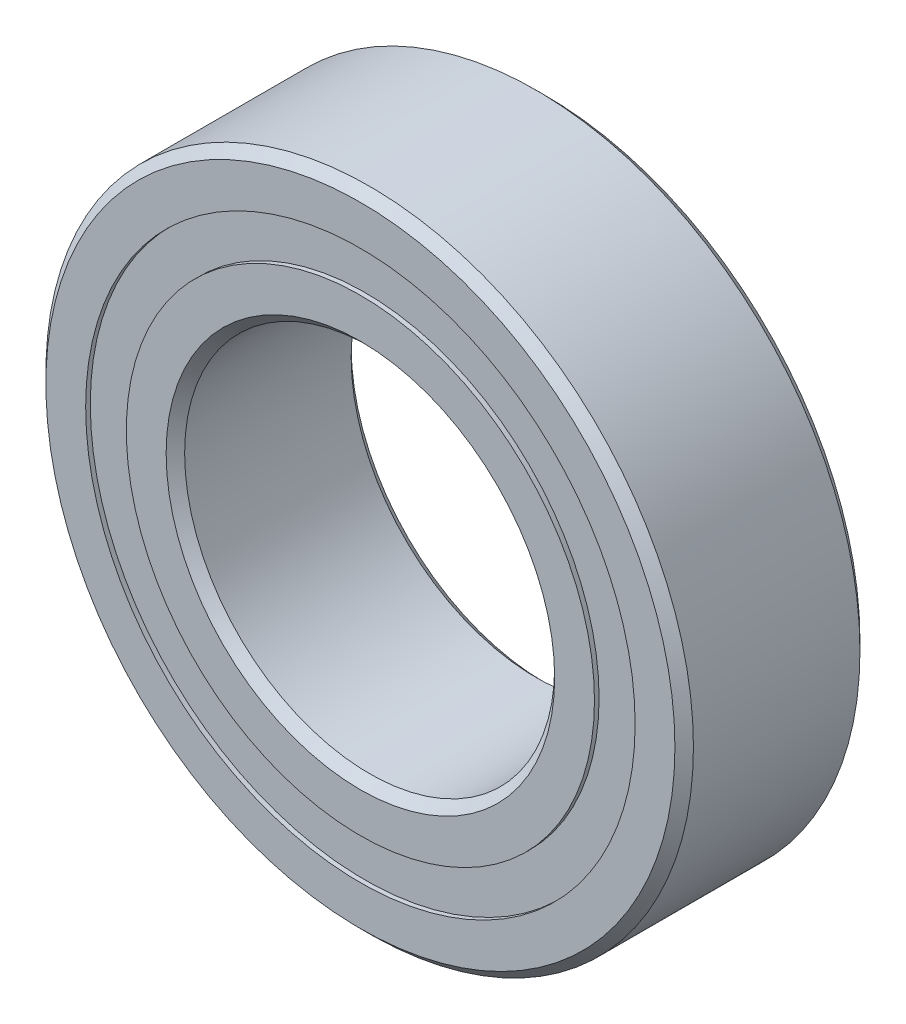
ISO-10303-21;
HEADER;
FILE_DESCRIPTION(('STEP AP214'),'2;1');
FILE_NAME('part.step','',(''),(''),'','','');
FILE_SCHEMA(('AUTOMOTIVE_DESIGN { 1 0 10303 214 1 1 1 1 }'));
ENDSEC;
DATA;
#1=APPLICATION_CONTEXT('core data for automotive mechanical design processes');
#2=APPLICATION_PROTOCOL_DEFINITION('international standard','automotive_design',2000,#1);
#3=PRODUCT_CONTEXT('',#1,'mechanical');
#4=PRODUCT('Part','Part','',(#3));
#5=PRODUCT_RELATED_PRODUCT_CATEGORY('part','',(#4));
#6=PRODUCT_DEFINITION_FORMATION('','',#4);
#7=PRODUCT_DEFINITION_CONTEXT('part definition',#1,'design');
#8=PRODUCT_DEFINITION('design','',#6,#7);
#9=PRODUCT_DEFINITION_SHAPE('','',#8);
#10=(LENGTH_UNIT() NAMED_UNIT(*) SI_UNIT(.MILLI.,.METRE.));
#11=(NAMED_UNIT(*) PLANE_ANGLE_UNIT() SI_UNIT($,.RADIAN.));
#12=(NAMED_UNIT(*) SI_UNIT($,.STERADIAN.) SOLID_ANGLE_UNIT());
#13=UNCERTAINTY_MEASURE_WITH_UNIT(LENGTH_MEASURE(1.E-05),#10,'distance_accuracy_value','');
#14=(GEOMETRIC_REPRESENTATION_CONTEXT(3) GLOBAL_UNCERTAINTY_ASSIGNED_CONTEXT((#13)) GLOBAL_UNIT_ASSIGNED_CONTEXT((#10,
#11,#12)) REPRESENTATION_CONTEXT('',''));
#15=CARTESIAN_POINT('',(0.,0.,0.));
#16=DIRECTION('',(0.,0.,1.));
#17=DIRECTION('',(1.,0.,0.));
#18=AXIS2_PLACEMENT_3D('',#15,#16,#17);
#19=CARTESIAN_POINT('',(0.,5.93956043956044,-1.9));
#20=DIRECTION('',(0.,0.,1.));
#21=DIRECTION('',(1.,0.,0.));
#22=AXIS2_PLACEMENT_3D('',#19,#20,#21);
#23=PLANE('',#22);
#24=CARTESIAN_POINT('',(0.,0.,-1.9));
#25=DIRECTION('',(0.,0.,1.));
#26=DIRECTION('',(1.,0.,0.));
#27=AXIS2_PLACEMENT_3D('',#24,#25,#26);
#28=CIRCLE('',#27,5.93956043956044);
#29=CARTESIAN_POINT('',(5.93956043956044,0.,-1.9));
#30=VERTEX_POINT('',#29);
#31=EDGE_CURVE('E56',#30,#30,#28,.T.);
#32=ORIENTED_EDGE('',*,*,#31,.F.);
#33=EDGE_LOOP('',(#32));
#34=FACE_BOUND('',#33,.T.);
#35=CARTESIAN_POINT('',(0.,0.,-1.9));
#36=DIRECTION('',(0.,0.,1.));
#37=DIRECTION('',(1.,0.,0.));
#38=AXIS2_PLACEMENT_3D('',#35,#36,#37);
#39=CIRCLE('',#38,5.06043956043956);
#40=CARTESIAN_POINT('',(5.06043956043956,0.,-1.9));
#41=VERTEX_POINT('',#40);
#42=EDGE_CURVE('E11',#41,#41,#39,.T.);
#43=ORIENTED_EDGE('',*,*,#42,.T.);
#44=EDGE_LOOP('',(#43));
#45=FACE_BOUND('',#44,.T.);
#46=ADVANCED_FACE('F42',(#34,#45),#23,.F.);
#47=CARTESIAN_POINT('',(0.,0.,2.));
#48=DIRECTION('',(0.,0.,1.));
#49=DIRECTION('',(1.,0.,0.));
#50=AXIS2_PLACEMENT_3D('',#47,#48,#49);
#51=CYLINDRICAL_SURFACE('',#50,5.06043956043956);
#52=ORIENTED_EDGE('',*,*,#42,.F.);
#53=EDGE_LOOP('',(#52));
#54=FACE_BOUND('',#53,.T.);
#55=CARTESIAN_POINT('',(0.,0.,-0.991633418565898));
#56=DIRECTION('',(0.,0.,1.));
#57=DIRECTION('',(1.,0.,0.));
#58=AXIS2_PLACEMENT_3D('',#55,#56,#57);
#59=CIRCLE('',#58,5.06043956043956);
#60=CARTESIAN_POINT('',(5.06043956043956,0.,-0.991633418565898));
#61=VERTEX_POINT('',#60);
#62=EDGE_CURVE('E48',#61,#61,#59,.T.);
#63=ORIENTED_EDGE('',*,*,#62,.T.);
#64=EDGE_LOOP('',(#63));
#65=FACE_BOUND('',#64,.T.);
#66=ADVANCED_FACE('F65',(#54,#65),#51,.F.);
#67=CARTESIAN_POINT('',(0.,5.93956043956044,-0.991633418565898));
#68=DIRECTION('',(0.,0.,-1.));
#69=DIRECTION('',(-1.,0.,0.));
#70=AXIS2_PLACEMENT_3D('',#67,#68,#69);
#71=PLANE('',#70);
#72=ORIENTED_EDGE('',*,*,#62,.F.);
#73=EDGE_LOOP('',(#72));
#74=FACE_BOUND('',#73,.T.);
#75=CARTESIAN_POINT('',(0.,0.,-0.991633418565898));
#76=DIRECTION('',(0.,0.,1.));
#77=DIRECTION('',(1.,0.,0.));
#78=AXIS2_PLACEMENT_3D('',#75,#76,#77);
#79=CIRCLE('',#78,5.93956043956044);
#80=CARTESIAN_POINT('',(5.93956043956044,0.,-0.991633418565898));
#81=VERTEX_POINT('',#80);
#82=EDGE_CURVE('E52',#81,#81,#79,.T.);
#83=ORIENTED_EDGE('',*,*,#82,.T.);
#84=EDGE_LOOP('',(#83));
#85=FACE_BOUND('',#84,.T.);
#86=ADVANCED_FACE('F69',(#74,#85),#71,.F.);
#87=CARTESIAN_POINT('',(0.,0.,2.));
#88=DIRECTION('',(0.,0.,1.));
#89=DIRECTION('',(1.,0.,0.));
#90=AXIS2_PLACEMENT_3D('',#87,#88,#89);
#91=CYLINDRICAL_SURFACE('',#90,5.93956043956044);
#92=ORIENTED_EDGE('',*,*,#82,.F.);
#93=EDGE_LOOP('',(#92));
#94=FACE_BOUND('',#93,.T.);
#95=ORIENTED_EDGE('',*,*,#31,.T.);
#96=EDGE_LOOP('',(#95));
#97=FACE_BOUND('',#96,.T.);
#98=ADVANCED_FACE('F62',(#94,#97),#91,.T.);
#99=CLOSED_SHELL('',(#46,#66,#86,#98));
#100=MANIFOLD_SOLID_BREP('B2',#99);
#101=CARTESIAN_POINT('',(0.,5.93956043956044,1.9));
#102=DIRECTION('',(0.,0.,-1.));
#103=DIRECTION('',(-1.,0.,0.));
#104=AXIS2_PLACEMENT_3D('',#101,#102,#103);
#105=PLANE('',#104);
#106=CARTESIAN_POINT('',(0.,0.,1.9));
#107=DIRECTION('',(0.,0.,1.));
#108=DIRECTION('',(1.,0.,0.));
#109=AXIS2_PLACEMENT_3D('',#106,#107,#108);
#110=CIRCLE('',#109,5.06043956043956);
#111=CARTESIAN_POINT('',(5.06043956043956,0.,1.9));
#112=VERTEX_POINT('',#111);
#113=EDGE_CURVE('E41',#112,#112,#110,.T.);
#114=ORIENTED_EDGE('',*,*,#113,.F.);
#115=EDGE_LOOP('',(#114));
#116=FACE_BOUND('',#115,.T.);
#117=CARTESIAN_POINT('',(0.,0.,1.9));
#118=DIRECTION('',(0.,0.,1.));
#119=DIRECTION('',(1.,0.,0.));
#120=AXIS2_PLACEMENT_3D('',#117,#118,#119);
#121=CIRCLE('',#120,5.93956043956044);
#122=CARTESIAN_POINT('',(5.93956043956044,0.,1.9));
#123=VERTEX_POINT('',#122);
#124=EDGE_CURVE('E124',#123,#123,#121,.T.);
#125=ORIENTED_EDGE('',*,*,#124,.T.);
#126=EDGE_LOOP('',(#125));
#127=FACE_BOUND('',#126,.T.);
#128=ADVANCED_FACE('F110',(#116,#127),#105,.F.);
#129=CARTESIAN_POINT('',(0.,0.,2.));
#130=DIRECTION('',(0.,0.,1.));
#131=DIRECTION('',(1.,0.,0.));
#132=AXIS2_PLACEMENT_3D('',#129,#130,#131);
#133=CYLINDRICAL_SURFACE('',#132,5.06043956043956);
#134=CARTESIAN_POINT('',(0.,0.,0.991633418565898));
#135=DIRECTION('',(0.,0.,1.));
#136=DIRECTION('',(1.,0.,0.));
#137=AXIS2_PLACEMENT_3D('',#134,#135,#136);
#138=CIRCLE('',#137,5.06043956043956);
#139=CARTESIAN_POINT('',(5.06043956043956,0.,0.991633418565898));
#140=VERTEX_POINT('',#139);
#141=EDGE_CURVE('E116',#140,#140,#138,.T.);
#142=ORIENTED_EDGE('',*,*,#141,.F.);
#143=EDGE_LOOP('',(#142));
#144=FACE_BOUND('',#143,.T.);
#145=ORIENTED_EDGE('',*,*,#113,.T.);
#146=EDGE_LOOP('',(#145));
#147=FACE_BOUND('',#146,.T.);
#148=ADVANCED_FACE('F139',(#144,#147),#133,.F.);
#149=CARTESIAN_POINT('',(0.,5.93956043956044,0.991633418565898));
#150=DIRECTION('',(0.,0.,1.));
#151=DIRECTION('',(1.,0.,0.));
#152=AXIS2_PLACEMENT_3D('',#149,#150,#151);
#153=PLANE('',#152);
#154=CARTESIAN_POINT('',(0.,0.,0.991633418565898));
#155=DIRECTION('',(0.,0.,1.));
#156=DIRECTION('',(1.,0.,0.));
#157=AXIS2_PLACEMENT_3D('',#154,#155,#156);
#158=CIRCLE('',#157,5.93956043956044);
#159=CARTESIAN_POINT('',(5.93956043956044,0.,0.991633418565898));
#160=VERTEX_POINT('',#159);
#161=EDGE_CURVE('E120',#160,#160,#158,.T.);
#162=ORIENTED_EDGE('',*,*,#161,.F.);
#163=EDGE_LOOP('',(#162));
#164=FACE_BOUND('',#163,.T.);
#165=ORIENTED_EDGE('',*,*,#141,.T.);
#166=EDGE_LOOP('',(#165));
#167=FACE_BOUND('',#166,.T.);
#168=ADVANCED_FACE('F134',(#164,#167),#153,.F.);
#169=CARTESIAN_POINT('',(0.,0.,2.));
#170=DIRECTION('',(0.,0.,1.));
#171=DIRECTION('',(1.,0.,0.));
#172=AXIS2_PLACEMENT_3D('',#169,#170,#171);
#173=CYLINDRICAL_SURFACE('',#172,5.93956043956044);
#174=ORIENTED_EDGE('',*,*,#124,.F.);
#175=EDGE_LOOP('',(#174));
#176=FACE_BOUND('',#175,.T.);
#177=ORIENTED_EDGE('',*,*,#161,.T.);
#178=EDGE_LOOP('',(#177));
#179=FACE_BOUND('',#178,.T.);
#180=ADVANCED_FACE('F131',(#176,#179),#173,.T.);
#181=CLOSED_SHELL('',(#128,#148,#168,#180));
#182=MANIFOLD_SOLID_BREP('B6',#181);
#183=CARTESIAN_POINT('',(-2.74999999999994,4.76313972081445,0.));
#184=DIRECTION('',(0.,0.,1.));
#185=DIRECTION('',(-0.499999999999989,0.866025403784445,0.));
#186=AXIS2_PLACEMENT_3D('',#183,#184,#185);
#187=SPHERICAL_SURFACE('',#186,0.991633418565898);
#188=CARTESIAN_POINT('',(-2.74999999999994,4.76313972081445,0.991633418565898));
#189=VERTEX_POINT('',#188);
#190=VERTEX_LOOP('',#189);
#191=FACE_BOUND('',#190,.T.);
#192=ADVANCED_FACE('F178',(#191),#187,.T.);
#193=CLOSED_SHELL('',(#192));
#194=MANIFOLD_SOLID_BREP('B36',#193);
#195=CARTESIAN_POINT('',(-4.76313972081438,2.75000000000006,0.));
#196=DIRECTION('',(0.,0.,1.));
#197=DIRECTION('',(-0.866025403784433,0.50000000000001,0.));
#198=AXIS2_PLACEMENT_3D('',#195,#196,#197);
#199=SPHERICAL_SURFACE('',#198,0.991633418565898);
#200=CARTESIAN_POINT('',(-4.76313972081438,2.75000000000006,0.991633418565898));
#201=VERTEX_POINT('',#200);
#202=VERTEX_LOOP('',#201);
#203=FACE_BOUND('',#202,.T.);
#204=ADVANCED_FACE('F199',(#203),#199,.T.);
#205=CLOSED_SHELL('',(#204));
#206=MANIFOLD_SOLID_BREP('B106',#205);
#207=CARTESIAN_POINT('',(-5.5,0.,0.));
#208=DIRECTION('',(0.,0.,1.));
#209=DIRECTION('',(-1.,0.,0.));
#210=AXIS2_PLACEMENT_3D('',#207,#208,#209);
#211=SPHERICAL_SURFACE('',#210,0.991633418565898);
#212=CARTESIAN_POINT('',(-5.5,0.,0.991633418565898));
#213=VERTEX_POINT('',#212);
#214=VERTEX_LOOP('',#213);
#215=FACE_BOUND('',#214,.T.);
#216=ADVANCED_FACE('F220',(#215),#211,.T.);
#217=CLOSED_SHELL('',(#216));
#218=MANIFOLD_SOLID_BREP('B174',#217);
#219=CARTESIAN_POINT('',(-4.76313972081444,-2.74999999999996,0.));
#220=DIRECTION('',(0.,0.,1.));
#221=DIRECTION('',(-0.866025403784443,-0.499999999999992,0.));
#222=AXIS2_PLACEMENT_3D('',#219,#220,#221);
#223=SPHERICAL_SURFACE('',#222,0.991633418565898);
#224=CARTESIAN_POINT('',(-4.76313972081444,-2.74999999999996,0.991633418565898));
#225=VERTEX_POINT('',#224);
#226=VERTEX_LOOP('',#225);
#227=FACE_BOUND('',#226,.T.);
#228=ADVANCED_FACE('F241',(#227),#223,.T.);
#229=CLOSED_SHELL('',(#228));
#230=MANIFOLD_SOLID_BREP('B195',#229);
#231=CARTESIAN_POINT('',(-2.75000000000004,-4.76313972081439,0.));
#232=DIRECTION('',(0.,0.,1.));
#233=DIRECTION('',(-0.500000000000007,-0.866025403784435,0.));
#234=AXIS2_PLACEMENT_3D('',#231,#232,#233);
#235=SPHERICAL_SURFACE('',#234,0.991633418565898);
#236=CARTESIAN_POINT('',(-2.75000000000004,-4.76313972081439,0.991633418565898));
#237=VERTEX_POINT('',#236);
#238=VERTEX_LOOP('',#237);
#239=FACE_BOUND('',#238,.T.);
#240=ADVANCED_FACE('F262',(#239),#235,.T.);
#241=CLOSED_SHELL('',(#240));
#242=MANIFOLD_SOLID_BREP('B216',#241);
#243=CARTESIAN_POINT('',(0.,-5.5,0.));
#244=DIRECTION('',(0.,0.,1.));
#245=DIRECTION('',(0.,-1.,0.));
#246=AXIS2_PLACEMENT_3D('',#243,#244,#245);
#247=SPHERICAL_SURFACE('',#246,0.991633418565898);
#248=CARTESIAN_POINT('',(0.,-5.5,0.991633418565898));
#249=VERTEX_POINT('',#248);
#250=VERTEX_LOOP('',#249);
#251=FACE_BOUND('',#250,.T.);
#252=ADVANCED_FACE('F283',(#251),#247,.T.);
#253=CLOSED_SHELL('',(#252));
#254=MANIFOLD_SOLID_BREP('B237',#253);
#255=CARTESIAN_POINT('',(2.74999999999997,-4.76313972081443,0.));
#256=DIRECTION('',(0.,0.,1.));
#257=DIRECTION('',(0.499999999999995,-0.866025403784442,0.));
#258=AXIS2_PLACEMENT_3D('',#255,#256,#257);
#259=SPHERICAL_SURFACE('',#258,0.991633418565898);
#260=CARTESIAN_POINT('',(2.74999999999997,-4.76313972081443,0.991633418565898));
#261=VERTEX_POINT('',#260);
#262=VERTEX_LOOP('',#261);
#263=FACE_BOUND('',#262,.T.);
#264=ADVANCED_FACE('F304',(#263),#259,.T.);
#265=CLOSED_SHELL('',(#264));
#266=MANIFOLD_SOLID_BREP('B258',#265);
#267=CARTESIAN_POINT('',(4.7631397208144,-2.75000000000002,0.));
#268=DIRECTION('',(0.,0.,1.));
#269=DIRECTION('',(0.866025403784436,-0.500000000000004,0.));
#270=AXIS2_PLACEMENT_3D('',#267,#268,#269);
#271=SPHERICAL_SURFACE('',#270,0.991633418565898);
#272=CARTESIAN_POINT('',(4.7631397208144,-2.75000000000002,0.991633418565898));
#273=VERTEX_POINT('',#272);
#274=VERTEX_LOOP('',#273);
#275=FACE_BOUND('',#274,.T.);
#276=ADVANCED_FACE('F325',(#275),#271,.T.);
#277=CLOSED_SHELL('',(#276));
#278=MANIFOLD_SOLID_BREP('B279',#277);
#279=CARTESIAN_POINT('',(5.5,0.,0.));
#280=DIRECTION('',(0.,0.,1.));
#281=DIRECTION('',(1.,0.,0.));
#282=AXIS2_PLACEMENT_3D('',#279,#280,#281);
#283=SPHERICAL_SURFACE('',#282,0.991633418565898);
#284=CARTESIAN_POINT('',(5.5,0.,0.991633418565898));
#285=VERTEX_POINT('',#284);
#286=VERTEX_LOOP('',#285);
#287=FACE_BOUND('',#286,.T.);
#288=ADVANCED_FACE('F346',(#287),#283,.T.);
#289=CLOSED_SHELL('',(#288));
#290=MANIFOLD_SOLID_BREP('B300',#289);
#291=CARTESIAN_POINT('',(4.76313972081442,2.74999999999999,0.));
#292=DIRECTION('',(0.,0.,1.));
#293=DIRECTION('',(0.86602540378444,0.499999999999998,0.));
#294=AXIS2_PLACEMENT_3D('',#291,#292,#293);
#295=SPHERICAL_SURFACE('',#294,0.991633418565898);
#296=CARTESIAN_POINT('',(4.76313972081442,2.74999999999999,0.991633418565898));
#297=VERTEX_POINT('',#296);
#298=VERTEX_LOOP('',#297);
#299=FACE_BOUND('',#298,.T.);
#300=ADVANCED_FACE('F367',(#299),#295,.T.);
#301=CLOSED_SHELL('',(#300));
#302=MANIFOLD_SOLID_BREP('B321',#301);
#303=CARTESIAN_POINT('',(2.75000000000001,4.76313972081441,0.));
#304=DIRECTION('',(0.,0.,1.));
#305=DIRECTION('',(0.500000000000001,0.866025403784438,0.));
#306=AXIS2_PLACEMENT_3D('',#303,#304,#305);
#307=SPHERICAL_SURFACE('',#306,0.991633418565898);
#308=CARTESIAN_POINT('',(2.75000000000001,4.76313972081441,0.991633418565898));
#309=VERTEX_POINT('',#308);
#310=VERTEX_LOOP('',#309);
#311=FACE_BOUND('',#310,.T.);
#312=ADVANCED_FACE('F388',(#311),#307,.T.);
#313=CLOSED_SHELL('',(#312));
#314=MANIFOLD_SOLID_BREP('B342',#313);
#315=CARTESIAN_POINT('',(0.,5.5,0.));
#316=DIRECTION('',(0.,0.,1.));
#317=DIRECTION('',(0.,1.,0.));
#318=AXIS2_PLACEMENT_3D('',#315,#316,#317);
#319=SPHERICAL_SURFACE('',#318,0.991633418565898);
#320=CARTESIAN_POINT('',(0.,5.5,0.991633418565898));
#321=VERTEX_POINT('',#320);
#322=VERTEX_LOOP('',#321);
#323=FACE_BOUND('',#322,.T.);
#324=ADVANCED_FACE('F411',(#323),#319,.T.);
#325=CLOSED_SHELL('',(#324));
#326=MANIFOLD_SOLID_BREP('B363',#325);
#327=CARTESIAN_POINT('',(0.,5.06043956043956,2.));
#328=DIRECTION('',(0.,0.,-1.));
#329=DIRECTION('',(-1.,0.,0.));
#330=AXIS2_PLACEMENT_3D('',#327,#328,#329);
#331=PLANE('',#330);
#332=CARTESIAN_POINT('',(0.,0.,2.));
#333=DIRECTION('',(0.,0.,1.));
#334=DIRECTION('',(1.,0.,0.));
#335=AXIS2_PLACEMENT_3D('',#332,#333,#334);
#336=CIRCLE('',#335,4.2);
#337=CARTESIAN_POINT('',(4.2,0.,2.));
#338=VERTEX_POINT('',#337);
#339=EDGE_CURVE('E459',#338,#338,#336,.T.);
#340=ORIENTED_EDGE('',*,*,#339,.F.);
#341=EDGE_LOOP('',(#340));
#342=FACE_BOUND('',#341,.T.);
#343=CARTESIAN_POINT('',(0.,0.,2.));
#344=DIRECTION('',(0.,0.,1.));
#345=DIRECTION('',(1.,0.,0.));
#346=AXIS2_PLACEMENT_3D('',#343,#344,#345);
#347=CIRCLE('',#346,5.06043956043956);
#348=CARTESIAN_POINT('',(5.06043956043956,0.,2.));
#349=VERTEX_POINT('',#348);
#350=EDGE_CURVE('E410',#349,#349,#347,.T.);
#351=ORIENTED_EDGE('',*,*,#350,.T.);
#352=EDGE_LOOP('',(#351));
#353=FACE_BOUND('',#352,.T.);
#354=ADVANCED_FACE('F431',(#342,#353),#331,.F.);
#355=CARTESIAN_POINT('',(0.,0.,2.));
#356=DIRECTION('',(0.,0.,1.));
#357=DIRECTION('',(1.,0.,0.));
#358=AXIS2_PLACEMENT_3D('',#355,#356,#357);
#359=CYLINDRICAL_SURFACE('',#358,5.06043956043956);
#360=ORIENTED_EDGE('',*,*,#350,.F.);
#361=EDGE_LOOP('',(#360));
#362=FACE_BOUND('',#361,.T.);
#363=CARTESIAN_POINT('',(0.,0.,0.888888888888889));
#364=DIRECTION('',(0.,0.,1.));
#365=DIRECTION('',(1.,0.,0.));
#366=AXIS2_PLACEMENT_3D('',#363,#364,#365);
#367=CIRCLE('',#366,5.06043956043956);
#368=CARTESIAN_POINT('',(5.06043956043956,0.,0.888888888888889));
#369=VERTEX_POINT('',#368);
#370=EDGE_CURVE('E437',#369,#369,#367,.T.);
#371=ORIENTED_EDGE('',*,*,#370,.T.);
#372=EDGE_LOOP('',(#371));
#373=FACE_BOUND('',#372,.T.);
#374=ADVANCED_FACE('F466',(#362,#373),#359,.T.);
#375=CARTESIAN_POINT('',(0.,0.,0.));
#376=DIRECTION('',(0.,0.,1.));
#377=DIRECTION('',(1.,0.,0.));
#378=AXIS2_PLACEMENT_3D('',#375,#376,#377);
#379=TOROIDAL_SURFACE('',#378,5.5,0.991633418565897);
#380=ORIENTED_EDGE('',*,*,#370,.F.);
#381=EDGE_LOOP('',(#380));
#382=FACE_BOUND('',#381,.T.);
#383=CARTESIAN_POINT('',(0.,0.,-0.88888888888889));
#384=DIRECTION('',(0.,0.,1.));
#385=DIRECTION('',(1.,0.,0.));
#386=AXIS2_PLACEMENT_3D('',#383,#384,#385);
#387=CIRCLE('',#386,5.06043956043956);
#388=CARTESIAN_POINT('',(5.06043956043956,0.,-0.88888888888889));
#389=VERTEX_POINT('',#388);
#390=EDGE_CURVE('E441',#389,#389,#387,.T.);
#391=ORIENTED_EDGE('',*,*,#390,.T.);
#392=EDGE_LOOP('',(#391));
#393=FACE_BOUND('',#392,.T.);
#394=ADVANCED_FACE('F470',(#382,#393),#379,.F.);
#395=CARTESIAN_POINT('',(0.,0.,2.));
#396=DIRECTION('',(0.,0.,1.));
#397=DIRECTION('',(1.,0.,0.));
#398=AXIS2_PLACEMENT_3D('',#395,#396,#397);
#399=CYLINDRICAL_SURFACE('',#398,5.06043956043956);
#400=ORIENTED_EDGE('',*,*,#390,.F.);
#401=EDGE_LOOP('',(#400));
#402=FACE_BOUND('',#401,.T.);
#403=CARTESIAN_POINT('',(0.,0.,-2.));
#404=DIRECTION('',(0.,0.,1.));
#405=DIRECTION('',(1.,0.,0.));
#406=AXIS2_PLACEMENT_3D('',#403,#404,#405);
#407=CIRCLE('',#406,5.06043956043956);
#408=CARTESIAN_POINT('',(5.06043956043956,0.,-2.));
#409=VERTEX_POINT('',#408);
#410=EDGE_CURVE('E445',#409,#409,#407,.T.);
#411=ORIENTED_EDGE('',*,*,#410,.T.);
#412=EDGE_LOOP('',(#411));
#413=FACE_BOUND('',#412,.T.);
#414=ADVANCED_FACE('F475',(#402,#413),#399,.T.);
#415=CARTESIAN_POINT('',(0.,4.2,-2.));
#416=DIRECTION('',(0.,0.,1.));
#417=DIRECTION('',(1.,0.,0.));
#418=AXIS2_PLACEMENT_3D('',#415,#416,#417);
#419=PLANE('',#418);
#420=ORIENTED_EDGE('',*,*,#410,.F.);
#421=EDGE_LOOP('',(#420));
#422=FACE_BOUND('',#421,.T.);
#423=CARTESIAN_POINT('',(0.,0.,-2.));
#424=DIRECTION('',(0.,0.,1.));
#425=DIRECTION('',(1.,0.,0.));
#426=AXIS2_PLACEMENT_3D('',#423,#424,#425);
#427=CIRCLE('',#426,4.2);
#428=CARTESIAN_POINT('',(4.2,0.,-2.));
#429=VERTEX_POINT('',#428);
#430=EDGE_CURVE('E450',#429,#429,#427,.T.);
#431=ORIENTED_EDGE('',*,*,#430,.T.);
#432=EDGE_LOOP('',(#431));
#433=FACE_BOUND('',#432,.T.);
#434=ADVANCED_FACE('F481',(#422,#433),#419,.F.);
#435=CARTESIAN_POINT('',(0.,0.,-1.8));
#436=DIRECTION('',(0.,0.,-1.));
#437=DIRECTION('',(-1.,0.,0.));
#438=AXIS2_PLACEMENT_3D('',#435,#436,#437);
#439=CONICAL_SURFACE('',#438,4.,0.785398163397446);
#440=ORIENTED_EDGE('',*,*,#430,.F.);
#441=EDGE_LOOP('',(#440));
#442=FACE_BOUND('',#441,.T.);
#443=CARTESIAN_POINT('',(0.,0.,-1.8));
#444=DIRECTION('',(0.,0.,1.));
#445=DIRECTION('',(1.,0.,0.));
#446=AXIS2_PLACEMENT_3D('',#443,#444,#445);
#447=CIRCLE('',#446,4.);
#448=CARTESIAN_POINT('',(4.,0.,-1.8));
#449=VERTEX_POINT('',#448);
#450=EDGE_CURVE('E453',#449,#449,#447,.T.);
#451=ORIENTED_EDGE('',*,*,#450,.T.);
#452=EDGE_LOOP('',(#451));
#453=FACE_BOUND('',#452,.T.);
#454=ADVANCED_FACE('F485',(#442,#453),#439,.F.);
#455=CARTESIAN_POINT('',(0.,0.,2.));
#456=DIRECTION('',(0.,0.,1.));
#457=DIRECTION('',(1.,0.,0.));
#458=AXIS2_PLACEMENT_3D('',#455,#456,#457);
#459=CYLINDRICAL_SURFACE('',#458,4.);
#460=ORIENTED_EDGE('',*,*,#450,.F.);
#461=EDGE_LOOP('',(#460));
#462=FACE_BOUND('',#461,.T.);
#463=CARTESIAN_POINT('',(0.,0.,1.8));
#464=DIRECTION('',(0.,0.,1.));
#465=DIRECTION('',(1.,0.,0.));
#466=AXIS2_PLACEMENT_3D('',#463,#464,#465);
#467=CIRCLE('',#466,4.);
#468=CARTESIAN_POINT('',(4.,0.,1.8));
#469=VERTEX_POINT('',#468);
#470=EDGE_CURVE('E456',#469,#469,#467,.T.);
#471=ORIENTED_EDGE('',*,*,#470,.T.);
#472=EDGE_LOOP('',(#471));
#473=FACE_BOUND('',#472,.T.);
#474=ADVANCED_FACE('F489',(#462,#473),#459,.F.);
#475=CARTESIAN_POINT('',(0.,0.,2.));
#476=DIRECTION('',(0.,0.,1.));
#477=DIRECTION('',(1.,0.,0.));
#478=AXIS2_PLACEMENT_3D('',#475,#476,#477);
#479=CONICAL_SURFACE('',#478,4.2,0.785398163397449);
#480=ORIENTED_EDGE('',*,*,#470,.F.);
#481=EDGE_LOOP('',(#480));
#482=FACE_BOUND('',#481,.T.);
#483=ORIENTED_EDGE('',*,*,#339,.T.);
#484=EDGE_LOOP('',(#483));
#485=FACE_BOUND('',#484,.T.);
#486=ADVANCED_FACE('F463',(#482,#485),#479,.F.);
#487=CLOSED_SHELL('',(#354,#374,#394,#414,#434,#454,#474,#486));
#488=MANIFOLD_SOLID_BREP('B384',#487);
#489=CARTESIAN_POINT('',(0.,0.,1.8));
#490=DIRECTION('',(0.,0.,-1.));
#491=DIRECTION('',(-1.,0.,0.));
#492=AXIS2_PLACEMENT_3D('',#489,#490,#491);
#493=CONICAL_SURFACE('',#492,7.,0.785398163397445);
#494=CARTESIAN_POINT('',(0.,0.,2.));
#495=DIRECTION('',(0.,0.,1.));
#496=DIRECTION('',(1.,0.,0.));
#497=AXIS2_PLACEMENT_3D('',#494,#495,#496);
#498=CIRCLE('',#497,6.8);
#499=CARTESIAN_POINT('',(6.8,0.,2.));
#500=VERTEX_POINT('',#499);
#501=EDGE_CURVE('E581',#500,#500,#498,.T.);
#502=ORIENTED_EDGE('',*,*,#501,.F.);
#503=EDGE_LOOP('',(#502));
#504=FACE_BOUND('',#503,.T.);
#505=CARTESIAN_POINT('',(0.,0.,1.8));
#506=DIRECTION('',(0.,0.,1.));
#507=DIRECTION('',(1.,0.,0.));
#508=AXIS2_PLACEMENT_3D('',#505,#506,#507);
#509=CIRCLE('',#508,7.);
#510=CARTESIAN_POINT('',(7.,0.,1.8));
#511=VERTEX_POINT('',#510);
#512=EDGE_CURVE('E430',#511,#511,#509,.T.);
#513=ORIENTED_EDGE('',*,*,#512,.T.);
#514=EDGE_LOOP('',(#513));
#515=FACE_BOUND('',#514,.T.);
#516=ADVANCED_FACE('F553',(#504,#515),#493,.T.);
#517=CARTESIAN_POINT('',(0.,0.,2.));
#518=DIRECTION('',(0.,0.,1.));
#519=DIRECTION('',(1.,0.,0.));
#520=AXIS2_PLACEMENT_3D('',#517,#518,#519);
#521=CYLINDRICAL_SURFACE('',#520,7.);
#522=ORIENTED_EDGE('',*,*,#512,.F.);
#523=EDGE_LOOP('',(#522));
#524=FACE_BOUND('',#523,.T.);
#525=CARTESIAN_POINT('',(0.,0.,-1.8));
#526=DIRECTION('',(0.,0.,1.));
#527=DIRECTION('',(1.,0.,0.));
#528=AXIS2_PLACEMENT_3D('',#525,#526,#527);
#529=CIRCLE('',#528,7.);
#530=CARTESIAN_POINT('',(7.,0.,-1.8));
#531=VERTEX_POINT('',#530);
#532=EDGE_CURVE('E559',#531,#531,#529,.T.);
#533=ORIENTED_EDGE('',*,*,#532,.T.);
#534=EDGE_LOOP('',(#533));
#535=FACE_BOUND('',#534,.T.);
#536=ADVANCED_FACE('F588',(#524,#535),#521,.T.);
#537=CARTESIAN_POINT('',(0.,0.,-2.));
#538=DIRECTION('',(0.,0.,1.));
#539=DIRECTION('',(1.,0.,0.));
#540=AXIS2_PLACEMENT_3D('',#537,#538,#539);
#541=CONICAL_SURFACE('',#540,6.8,0.785398163397446);
#542=ORIENTED_EDGE('',*,*,#532,.F.);
#543=EDGE_LOOP('',(#542));
#544=FACE_BOUND('',#543,.T.);
#545=CARTESIAN_POINT('',(0.,0.,-2.));
#546=DIRECTION('',(0.,0.,1.));
#547=DIRECTION('',(1.,0.,0.));
#548=AXIS2_PLACEMENT_3D('',#545,#546,#547);
#549=CIRCLE('',#548,6.8);
#550=CARTESIAN_POINT('',(6.8,0.,-2.));
#551=VERTEX_POINT('',#550);
#552=EDGE_CURVE('E563',#551,#551,#549,.T.);
#553=ORIENTED_EDGE('',*,*,#552,.T.);
#554=EDGE_LOOP('',(#553));
#555=FACE_BOUND('',#554,.T.);
#556=ADVANCED_FACE('F592',(#544,#555),#541,.T.);
#557=CARTESIAN_POINT('',(0.,6.8,-2.));
#558=DIRECTION('',(0.,0.,1.));
#559=DIRECTION('',(1.,0.,0.));
#560=AXIS2_PLACEMENT_3D('',#557,#558,#559);
#561=PLANE('',#560);
#562=ORIENTED_EDGE('',*,*,#552,.F.);
#563=EDGE_LOOP('',(#562));
#564=FACE_BOUND('',#563,.T.);
#565=CARTESIAN_POINT('',(0.,0.,-2.));
#566=DIRECTION('',(0.,0.,1.));
#567=DIRECTION('',(1.,0.,0.));
#568=AXIS2_PLACEMENT_3D('',#565,#566,#567);
#569=CIRCLE('',#568,5.93956043956044);
#570=CARTESIAN_POINT('',(5.93956043956044,0.,-2.));
#571=VERTEX_POINT('',#570);
#572=EDGE_CURVE('E567',#571,#571,#569,.T.);
#573=ORIENTED_EDGE('',*,*,#572,.T.);
#574=EDGE_LOOP('',(#573));
#575=FACE_BOUND('',#574,.T.);
#576=ADVANCED_FACE('F597',(#564,#575),#561,.F.);
#577=CARTESIAN_POINT('',(0.,0.,2.));
#578=DIRECTION('',(0.,0.,1.));
#579=DIRECTION('',(1.,0.,0.));
#580=AXIS2_PLACEMENT_3D('',#577,#578,#579);
#581=CYLINDRICAL_SURFACE('',#580,5.93956043956044);
#582=ORIENTED_EDGE('',*,*,#572,.F.);
#583=EDGE_LOOP('',(#582));
#584=FACE_BOUND('',#583,.T.);
#585=CARTESIAN_POINT('',(0.,0.,-0.888888888888889));
#586=DIRECTION('',(0.,0.,1.));
#587=DIRECTION('',(1.,0.,0.));
#588=AXIS2_PLACEMENT_3D('',#585,#586,#587);
#589=CIRCLE('',#588,5.93956043956044);
#590=CARTESIAN_POINT('',(5.93956043956044,0.,-0.888888888888889));
#591=VERTEX_POINT('',#590);
#592=EDGE_CURVE('E572',#591,#591,#589,.T.);
#593=ORIENTED_EDGE('',*,*,#592,.T.);
#594=EDGE_LOOP('',(#593));
#595=FACE_BOUND('',#594,.T.);
#596=ADVANCED_FACE('F603',(#584,#595),#581,.F.);
#597=CARTESIAN_POINT('',(0.,0.,0.));
#598=DIRECTION('',(0.,0.,1.));
#599=DIRECTION('',(1.,0.,0.));
#600=AXIS2_PLACEMENT_3D('',#597,#598,#599);
#601=TOROIDAL_SURFACE('',#600,5.5,0.991633418565898);
#602=ORIENTED_EDGE('',*,*,#592,.F.);
#603=EDGE_LOOP('',(#602));
#604=FACE_BOUND('',#603,.T.);
#605=CARTESIAN_POINT('',(0.,0.,0.888888888888889));
#606=DIRECTION('',(0.,0.,1.));
#607=DIRECTION('',(1.,0.,0.));
#608=AXIS2_PLACEMENT_3D('',#605,#606,#607);
#609=CIRCLE('',#608,5.93956043956044);
#610=CARTESIAN_POINT('',(5.93956043956044,0.,0.888888888888889));
#611=VERTEX_POINT('',#610);
#612=EDGE_CURVE('E575',#611,#611,#609,.T.);
#613=ORIENTED_EDGE('',*,*,#612,.T.);
#614=EDGE_LOOP('',(#613));
#615=FACE_BOUND('',#614,.T.);
#616=ADVANCED_FACE('F607',(#604,#615),#601,.F.);
#617=CARTESIAN_POINT('',(0.,0.,2.));
#618=DIRECTION('',(0.,0.,1.));
#619=DIRECTION('',(1.,0.,0.));
#620=AXIS2_PLACEMENT_3D('',#617,#618,#619);
#621=CYLINDRICAL_SURFACE('',#620,5.93956043956044);
#622=ORIENTED_EDGE('',*,*,#612,.F.);
#623=EDGE_LOOP('',(#622));
#624=FACE_BOUND('',#623,.T.);
#625=CARTESIAN_POINT('',(0.,0.,2.));
#626=DIRECTION('',(0.,0.,1.));
#627=DIRECTION('',(1.,0.,0.));
#628=AXIS2_PLACEMENT_3D('',#625,#626,#627);
#629=CIRCLE('',#628,5.93956043956044);
#630=CARTESIAN_POINT('',(5.93956043956044,0.,2.));
#631=VERTEX_POINT('',#630);
#632=EDGE_CURVE('E578',#631,#631,#629,.T.);
#633=ORIENTED_EDGE('',*,*,#632,.T.);
#634=EDGE_LOOP('',(#633));
#635=FACE_BOUND('',#634,.T.);
#636=ADVANCED_FACE('F611',(#624,#635),#621,.F.);
#637=CARTESIAN_POINT('',(0.,6.8,2.));
#638=DIRECTION('',(0.,0.,-1.));
#639=DIRECTION('',(-1.,0.,0.));
#640=AXIS2_PLACEMENT_3D('',#637,#638,#639);
#641=PLANE('',#640);
#642=ORIENTED_EDGE('',*,*,#632,.F.);
#643=EDGE_LOOP('',(#642));
#644=FACE_BOUND('',#643,.T.);
#645=ORIENTED_EDGE('',*,*,#501,.T.);
#646=EDGE_LOOP('',(#645));
#647=FACE_BOUND('',#646,.T.);
#648=ADVANCED_FACE('F585',(#644,#647),#641,.F.);
#649=CLOSED_SHELL('',(#516,#536,#556,#576,#596,#616,#636,#648));
#650=MANIFOLD_SOLID_BREP('B405',#649);
#651=ADVANCED_BREP_SHAPE_REPRESENTATION('',(#18,#100,#182,#194,#206,#218,#230,#242,#254,#266,
#278,#290,#302,#314,#326,#488,#650),#14);
#652=SHAPE_DEFINITION_REPRESENTATION(#9,#651);
ENDSEC;
END-ISO-10303-21;
